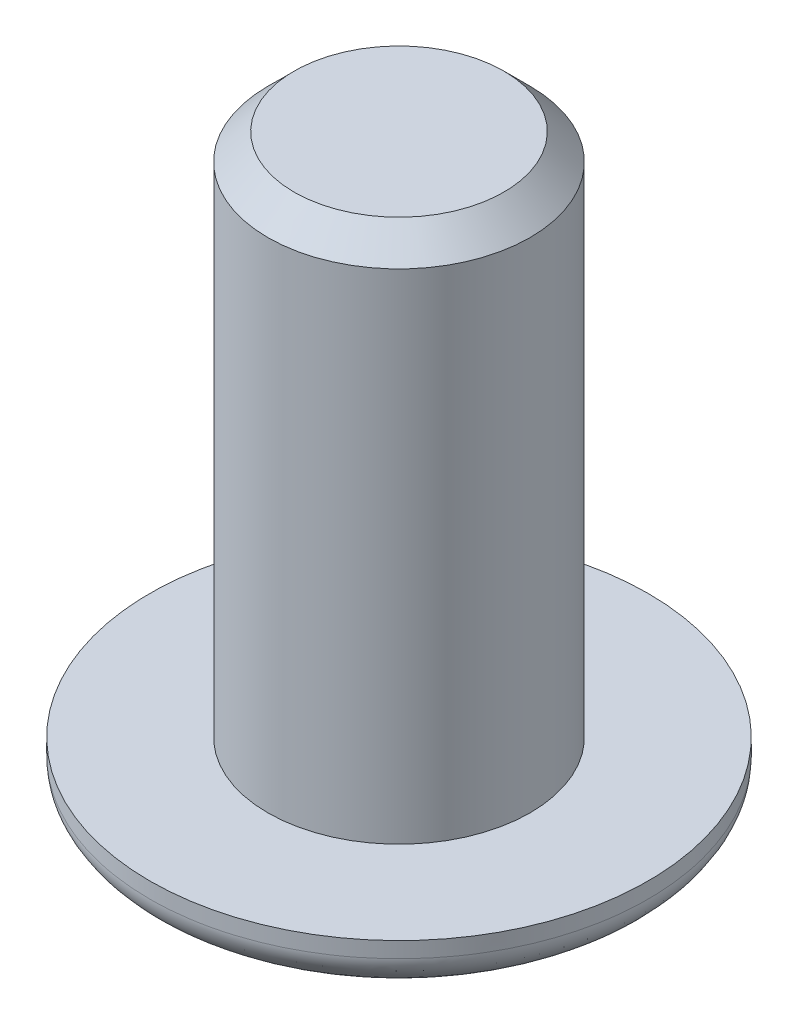
ISO-10303-21;
HEADER;
FILE_DESCRIPTION(('STEP AP214'),'2;1');
FILE_NAME('part.step','',(''),(''),'','','');
FILE_SCHEMA(('AUTOMOTIVE_DESIGN { 1 0 10303 214 1 1 1 1 }'));
ENDSEC;
DATA;
#1=APPLICATION_CONTEXT('core data for automotive mechanical design processes');
#2=APPLICATION_PROTOCOL_DEFINITION('international standard','automotive_design',2000,#1);
#3=PRODUCT_CONTEXT('',#1,'mechanical');
#4=PRODUCT('Part','Part','',(#3));
#5=PRODUCT_RELATED_PRODUCT_CATEGORY('part','',(#4));
#6=PRODUCT_DEFINITION_FORMATION('','',#4);
#7=PRODUCT_DEFINITION_CONTEXT('part definition',#1,'design');
#8=PRODUCT_DEFINITION('design','',#6,#7);
#9=PRODUCT_DEFINITION_SHAPE('','',#8);
#10=(LENGTH_UNIT() NAMED_UNIT(*) SI_UNIT(.MILLI.,.METRE.));
#11=(NAMED_UNIT(*) PLANE_ANGLE_UNIT() SI_UNIT($,.RADIAN.));
#12=(NAMED_UNIT(*) SI_UNIT($,.STERADIAN.) SOLID_ANGLE_UNIT());
#13=UNCERTAINTY_MEASURE_WITH_UNIT(LENGTH_MEASURE(1.E-05),#10,'distance_accuracy_value','');
#14=(GEOMETRIC_REPRESENTATION_CONTEXT(3) GLOBAL_UNCERTAINTY_ASSIGNED_CONTEXT((#13)) GLOBAL_UNIT_ASSIGNED_CONTEXT((#10,
#11,#12)) REPRESENTATION_CONTEXT('',''));
#15=CARTESIAN_POINT('',(0.,0.,0.));
#16=DIRECTION('',(0.,0.,1.));
#17=DIRECTION('',(1.,0.,0.));
#18=AXIS2_PLACEMENT_3D('',#15,#16,#17);
#19=CARTESIAN_POINT('',(0.,1.3,0.));
#20=DIRECTION('',(0.,1.,0.));
#21=DIRECTION('',(0.,0.,1.));
#22=AXIS2_PLACEMENT_3D('',#19,#20,#21);
#23=PLANE('',#22);
#24=CARTESIAN_POINT('',(0.,1.3,0.));
#25=DIRECTION('',(0.,1.,0.));
#26=DIRECTION('',(0.,0.,1.));
#27=AXIS2_PLACEMENT_3D('',#24,#25,#26);
#28=CIRCLE('',#27,2.5);
#29=CARTESIAN_POINT('',(0.,1.3,2.5));
#30=VERTEX_POINT('',#29);
#31=EDGE_CURVE('E295',#30,#30,#28,.T.);
#32=ORIENTED_EDGE('',*,*,#31,.F.);
#33=EDGE_LOOP('',(#32));
#34=FACE_BOUND('',#33,.T.);
#35=CARTESIAN_POINT('',(0.,1.3,0.));
#36=DIRECTION('',(0.,1.,0.));
#37=DIRECTION('',(0.,0.,1.));
#38=AXIS2_PLACEMENT_3D('',#35,#36,#37);
#39=CIRCLE('',#38,4.75);
#40=CARTESIAN_POINT('',(0.,1.3,4.75));
#41=VERTEX_POINT('',#40);
#42=EDGE_CURVE('E134',#41,#41,#39,.T.);
#43=ORIENTED_EDGE('',*,*,#42,.T.);
#44=EDGE_LOOP('',(#43));
#45=FACE_BOUND('',#44,.T.);
#46=ADVANCED_FACE('F39',(#34,#45),#23,.T.);
#47=CARTESIAN_POINT('',(0.,0.,0.));
#48=DIRECTION('',(0.,1.,0.));
#49=DIRECTION('',(0.,0.,1.));
#50=AXIS2_PLACEMENT_3D('',#47,#48,#49);
#51=PLANE('',#50);
#52=CARTESIAN_POINT('',(0.,0.,2.75));
#53=CARTESIAN_POINT('',(0.359974150290737,0.,2.75));
#54=CARTESIAN_POINT('',(0.719806689317475,0.,2.67842485780194));
#55=CARTESIAN_POINT('',(1.38495218869052,0.,2.40291257101014));
#56=CARTESIAN_POINT('',(1.69000348554074,0.,2.19908381098528));
#57=CARTESIAN_POINT('',(2.19908381098528,0.,1.69000348554074));
#58=CARTESIAN_POINT('',(2.40291257101014,0.,1.38495218869056));
#59=CARTESIAN_POINT('',(2.67842485780194,0.,0.719806689317434));
#60=CARTESIAN_POINT('',(2.75,0.,0.359974150290516));
#61=CARTESIAN_POINT('',(2.75,0.,-0.359974150290515));
#62=CARTESIAN_POINT('',(2.67842485780194,0.,-0.719806689317437));
#63=CARTESIAN_POINT('',(2.40291257101014,0.,-1.38495218869056));
#64=CARTESIAN_POINT('',(2.19908381098527,0.,-1.69000348554074));
#65=CARTESIAN_POINT('',(1.69000348554073,0.,-2.19908381098528));
#66=CARTESIAN_POINT('',(1.38495218869055,0.,-2.40291257101014));
#67=CARTESIAN_POINT('',(0.719806689317447,0.,-2.67842485780193));
#68=CARTESIAN_POINT('',(0.359974150290516,0.,-2.75));
#69=CARTESIAN_POINT('',(-0.359974150290515,0.,-2.75));
#70=CARTESIAN_POINT('',(-0.71980668931744,0.,-2.67842485780193));
#71=CARTESIAN_POINT('',(-1.38495218869055,0.,-2.40291257101015));
#72=CARTESIAN_POINT('',(-1.69000348554074,0.,-2.19908381098527));
#73=CARTESIAN_POINT('',(-2.19908381098528,0.,-1.69000348554073));
#74=CARTESIAN_POINT('',(-2.40291257101014,0.,-1.38495218869055));
#75=CARTESIAN_POINT('',(-2.67842485780193,0.,-0.719806689317447));
#76=CARTESIAN_POINT('',(-2.75,0.,-0.359974150290512));
#77=CARTESIAN_POINT('',(-2.75,0.,0.35997415029052));
#78=CARTESIAN_POINT('',(-2.67842485780193,0.,0.719806689317439));
#79=CARTESIAN_POINT('',(-2.40291257101015,0.,1.38495218869055));
#80=CARTESIAN_POINT('',(-2.19908381098532,0.,1.69000348554073));
#81=CARTESIAN_POINT('',(-1.6900034855407,0.,2.19908381098527));
#82=CARTESIAN_POINT('',(-1.38495218869055,0.,2.40291257101014));
#83=CARTESIAN_POINT('',(-0.719806689317447,0.,2.67842485780193));
#84=CARTESIAN_POINT('',(-0.359974150290737,0.,2.75));
#85=CARTESIAN_POINT('',(0.,0.,2.75));
#86=(BOUNDED_CURVE() B_SPLINE_CURVE(3,(#52,#53,#54,#55,#56,#57,#58,#59,#60,#61,#62,#63,#64,#65,
#66,#67,#68,#69,#70,#71,#72,#73,#74,#75,#76,#77,#78,#79,#80,#81,#82,#83,#84,#85),.UNSPECIFIED.,
.T.,.F.) B_SPLINE_CURVE_WITH_KNOTS((4,2,2,2,2,2,2,2,2,2,2,2,2,2,2,2,4),(0.,0.392699081698724,
0.785398163397448,1.17809724509617,1.5707963267949,1.96349540849362,2.35619449019234,
2.74889357189107,3.14159265358979,3.53429173528852,3.92699081698724,4.31968989868597,
4.71238898038469,5.10508806208341,5.49778714378214,5.89048622548086,6.28318530717959),
.UNSPECIFIED.) CURVE() GEOMETRIC_REPRESENTATION_ITEM() RATIONAL_B_SPLINE_CURVE((1.,1.,1.,1.,1.,
1.,1.,1.,1.,1.,1.,1.,1.,1.,1.,1.,1.,1.,1.,1.,1.,1.,1.,1.,1.,1.,1.,1.,1.,1.,1.,1.,1.,1.)) REPRESENTATION_ITEM(''));
#87=CARTESIAN_POINT('',(0.,0.,2.75));
#88=VERTEX_POINT('',#87);
#89=EDGE_CURVE('E12',#88,#88,#86,.F.);
#90=ORIENTED_EDGE('',*,*,#89,.T.);
#91=EDGE_LOOP('',(#90));
#92=FACE_BOUND('',#91,.T.);
#93=DIRECTION('',(0.866025403784439,0.,0.5));
#94=VECTOR('',#93,1.);
#95=CARTESIAN_POINT('',(-1.50000000000001,0.,0.866025403784444));
#96=LINE('',#95,#94);
#97=CARTESIAN_POINT('',(-1.50000000000001,0.,0.866025403784444));
#98=VERTEX_POINT('',#97);
#99=CARTESIAN_POINT('',(0.,0.,1.73205080756888));
#100=VERTEX_POINT('',#99);
#101=EDGE_CURVE('E60',#98,#100,#96,.T.);
#102=ORIENTED_EDGE('',*,*,#101,.T.);
#103=DIRECTION('',(0.866025403784439,0.,-0.5));
#104=VECTOR('',#103,1.);
#105=CARTESIAN_POINT('',(0.,0.,1.73205080756888));
#106=LINE('',#105,#104);
#107=CARTESIAN_POINT('',(1.5,0.,0.866025403784438));
#108=VERTEX_POINT('',#107);
#109=EDGE_CURVE('E120',#100,#108,#106,.T.);
#110=ORIENTED_EDGE('',*,*,#109,.T.);
#111=DIRECTION('',(0.,0.,-1.));
#112=VECTOR('',#111,1.);
#113=CARTESIAN_POINT('',(1.5,0.,0.866025403784438));
#114=LINE('',#113,#112);
#115=CARTESIAN_POINT('',(1.5,0.,-0.866025403784452));
#116=VERTEX_POINT('',#115);
#117=EDGE_CURVE('E118',#108,#116,#114,.T.);
#118=ORIENTED_EDGE('',*,*,#117,.T.);
#119=DIRECTION('',(-0.866025403784438,0.,-0.500000000000001));
#120=VECTOR('',#119,1.);
#121=CARTESIAN_POINT('',(1.5,0.,-0.866025403784452));
#122=LINE('',#121,#120);
#123=CARTESIAN_POINT('',(0.,0.,-1.73205080756889));
#124=VERTEX_POINT('',#123);
#125=EDGE_CURVE('E96',#116,#124,#122,.T.);
#126=ORIENTED_EDGE('',*,*,#125,.T.);
#127=DIRECTION('',(-0.866025403784438,0.,0.5));
#128=VECTOR('',#127,1.);
#129=CARTESIAN_POINT('',(0.,0.,-1.73205080756889));
#130=LINE('',#129,#128);
#131=CARTESIAN_POINT('',(-1.50000000000001,0.,-0.866025403784447));
#132=VERTEX_POINT('',#131);
#133=EDGE_CURVE('E107',#124,#132,#130,.T.);
#134=ORIENTED_EDGE('',*,*,#133,.T.);
#135=DIRECTION('',(0.,0.,1.));
#136=VECTOR('',#135,1.);
#137=CARTESIAN_POINT('',(-1.50000000000001,0.,-0.866025403784447));
#138=LINE('',#137,#136);
#139=EDGE_CURVE('E113',#132,#98,#138,.T.);
#140=ORIENTED_EDGE('',*,*,#139,.T.);
#141=EDGE_LOOP('',(#102,#110,#118,#126,#134,#140));
#142=FACE_BOUND('',#141,.T.);
#143=ADVANCED_FACE('F115',(#92,#142),#51,.F.);
#144=CARTESIAN_POINT('',(0.,1.3,0.));
#145=DIRECTION('',(0.,-1.,0.));
#146=DIRECTION('',(0.,0.,-1.));
#147=AXIS2_PLACEMENT_3D('',#144,#145,#146);
#148=CYLINDRICAL_SURFACE('',#147,4.75);
#149=CARTESIAN_POINT('',(0.,1.,4.75));
#150=CARTESIAN_POINT('',(-0.621773532320364,1.,4.75));
#151=CARTESIAN_POINT('',(-1.24330246336651,1.,4.62637020893059));
#152=CARTESIAN_POINT('',(-2.39219014410186,1.,4.15048534992663));
#153=CARTESIAN_POINT('',(-2.91909692957037,1.,3.79841749170183));
#154=CARTESIAN_POINT('',(-3.79841749170185,1.,2.91909692957035));
#155=CARTESIAN_POINT('',(-4.15048534992664,1.,2.39219014410185));
#156=CARTESIAN_POINT('',(-4.62637020893059,1.,1.24330246336649));
#157=CARTESIAN_POINT('',(-4.75,1.,0.62177353231999));
#158=CARTESIAN_POINT('',(-4.75,1.,-0.621773532319975));
#159=CARTESIAN_POINT('',(-4.62637020893059,1.,-1.24330246336651));
#160=CARTESIAN_POINT('',(-4.15048534992663,1.,-2.39219014410186));
#161=CARTESIAN_POINT('',(-3.79841749170184,1.,-2.91909692957036));
#162=CARTESIAN_POINT('',(-2.91909692957036,1.,-3.79841749170184));
#163=CARTESIAN_POINT('',(-2.39219014410185,1.,-4.15048534992664));
#164=CARTESIAN_POINT('',(-1.24330246336649,1.,-4.62637020893059));
#165=CARTESIAN_POINT('',(-0.621773532319981,1.,-4.75));
#166=CARTESIAN_POINT('',(0.621773532319982,1.,-4.75));
#167=CARTESIAN_POINT('',(1.24330246336651,1.,-4.62637020893059));
#168=CARTESIAN_POINT('',(2.39219014410186,1.,-4.15048534992663));
#169=CARTESIAN_POINT('',(2.91909692957036,1.,-3.79841749170184));
#170=CARTESIAN_POINT('',(3.79841749170184,1.,-2.91909692957036));
#171=CARTESIAN_POINT('',(4.15048534992661,1.,-2.39219014410191));
#172=CARTESIAN_POINT('',(4.62637020893061,1.,-1.24330246336645));
#173=CARTESIAN_POINT('',(4.75,1.,-0.621773532319981));
#174=CARTESIAN_POINT('',(4.75,1.,0.621773532319982));
#175=CARTESIAN_POINT('',(4.62637020893059,1.,1.2433024633665));
#176=CARTESIAN_POINT('',(4.15048534992664,1.,2.39219014410185));
#177=CARTESIAN_POINT('',(3.79841749170187,1.,2.91909692957033));
#178=CARTESIAN_POINT('',(2.91909692957033,1.,3.79841749170187));
#179=CARTESIAN_POINT('',(2.39219014410182,1.,4.15048534992665));
#180=CARTESIAN_POINT('',(1.24330246336654,1.,4.62637020893057));
#181=CARTESIAN_POINT('',(0.621773532320364,1.,4.75));
#182=CARTESIAN_POINT('',(0.,1.,4.75));
#183=(BOUNDED_CURVE() B_SPLINE_CURVE(3,(#149,#150,#151,#152,#153,#154,#155,#156,#157,#158,#159,
#160,#161,#162,#163,#164,#165,#166,#167,#168,#169,#170,#171,#172,#173,#174,#175,#176,#177,#178,
#179,#180,#181,#182),.UNSPECIFIED.,.T.,.F.) B_SPLINE_CURVE_WITH_KNOTS((4,2,2,2,2,2,2,2,2,2,2,2,
2,2,2,2,4),(0.,0.392699081698725,0.785398163397448,1.17809724509617,1.5707963267949,
1.96349540849362,2.35619449019234,2.74889357189107,3.14159265358979,3.53429173528852,
3.92699081698724,4.31968989868597,4.71238898038469,5.10508806208341,5.49778714378214,
5.89048622548086,6.28318530717959),
.UNSPECIFIED.) CURVE() GEOMETRIC_REPRESENTATION_ITEM() RATIONAL_B_SPLINE_CURVE((1.,1.,1.,1.,1.,
1.,1.,1.,1.,1.,1.,1.,1.,1.,1.,1.,1.,1.,1.,1.,1.,1.,1.,1.,1.,1.,1.,1.,1.,1.,1.,1.,1.,1.)) REPRESENTATION_ITEM(''));
#184=CARTESIAN_POINT('',(0.,1.,4.75));
#185=VERTEX_POINT('',#184);
#186=EDGE_CURVE('E53',#185,#185,#183,.F.);
#187=ORIENTED_EDGE('',*,*,#186,.T.);
#188=EDGE_LOOP('',(#187));
#189=FACE_BOUND('',#188,.T.);
#190=ORIENTED_EDGE('',*,*,#42,.F.);
#191=EDGE_LOOP('',(#190));
#192=FACE_BOUND('',#191,.T.);
#193=ADVANCED_FACE('F152',(#189,#192),#148,.T.);
#194=CARTESIAN_POINT('',(-1.50000000000001,1.3,0.866025403784444));
#195=DIRECTION('',(0.5,0.,-0.866025403784439));
#196=DIRECTION('',(-0.866025403784439,0.,-0.5));
#197=AXIS2_PLACEMENT_3D('',#194,#195,#196);
#198=PLANE('',#197);
#199=ORIENTED_EDGE('',*,*,#101,.F.);
#200=DIRECTION('',(0.,-1.,0.));
#201=VECTOR('',#200,1.);
#202=CARTESIAN_POINT('',(-1.50000000000001,1.3,0.866025403784444));
#203=LINE('',#202,#201);
#204=CARTESIAN_POINT('',(-1.50000000000001,1.3,0.866025403784444));
#205=VERTEX_POINT('',#204);
#206=EDGE_CURVE('E125',#205,#98,#203,.T.);
#207=ORIENTED_EDGE('',*,*,#206,.F.);
#208=DIRECTION('',(0.866025403784439,0.,0.5));
#209=VECTOR('',#208,1.);
#210=CARTESIAN_POINT('',(-1.50000000000001,1.3,0.866025403784444));
#211=LINE('',#210,#209);
#212=CARTESIAN_POINT('',(0.,1.3,1.73205080756888));
#213=VERTEX_POINT('',#212);
#214=EDGE_CURVE('E69',#205,#213,#211,.T.);
#215=ORIENTED_EDGE('',*,*,#214,.T.);
#216=DIRECTION('',(0.,-1.,0.));
#217=VECTOR('',#216,1.);
#218=CARTESIAN_POINT('',(0.,1.3,1.73205080756888));
#219=LINE('',#218,#217);
#220=EDGE_CURVE('E132',#213,#100,#219,.T.);
#221=ORIENTED_EDGE('',*,*,#220,.T.);
#222=EDGE_LOOP('',(#199,#207,#215,#221));
#223=FACE_BOUND('',#222,.T.);
#224=ADVANCED_FACE('F161',(#223),#198,.T.);
#225=CARTESIAN_POINT('',(0.,1.3,1.73205080756888));
#226=DIRECTION('',(-0.5,0.,-0.866025403784439));
#227=DIRECTION('',(-0.866025403784439,0.,0.5));
#228=AXIS2_PLACEMENT_3D('',#225,#226,#227);
#229=PLANE('',#228);
#230=ORIENTED_EDGE('',*,*,#109,.F.);
#231=ORIENTED_EDGE('',*,*,#220,.F.);
#232=DIRECTION('',(0.866025403784439,0.,-0.5));
#233=VECTOR('',#232,1.);
#234=CARTESIAN_POINT('',(0.,1.3,1.73205080756888));
#235=LINE('',#234,#233);
#236=CARTESIAN_POINT('',(1.5,1.3,0.866025403784438));
#237=VERTEX_POINT('',#236);
#238=EDGE_CURVE('E300',#213,#237,#235,.T.);
#239=ORIENTED_EDGE('',*,*,#238,.T.);
#240=DIRECTION('',(0.,-1.,0.));
#241=VECTOR('',#240,1.);
#242=CARTESIAN_POINT('',(1.5,1.3,0.866025403784438));
#243=LINE('',#242,#241);
#244=EDGE_CURVE('E130',#237,#108,#243,.T.);
#245=ORIENTED_EDGE('',*,*,#244,.T.);
#246=EDGE_LOOP('',(#230,#231,#239,#245));
#247=FACE_BOUND('',#246,.T.);
#248=ADVANCED_FACE('F192',(#247),#229,.T.);
#249=CARTESIAN_POINT('',(1.5,1.3,0.866025403784438));
#250=DIRECTION('',(-1.,0.,0.));
#251=DIRECTION('',(0.,0.,1.));
#252=AXIS2_PLACEMENT_3D('',#249,#250,#251);
#253=PLANE('',#252);
#254=ORIENTED_EDGE('',*,*,#117,.F.);
#255=ORIENTED_EDGE('',*,*,#244,.F.);
#256=DIRECTION('',(0.,0.,-1.));
#257=VECTOR('',#256,1.);
#258=CARTESIAN_POINT('',(1.5,1.3,0.866025403784438));
#259=LINE('',#258,#257);
#260=CARTESIAN_POINT('',(1.5,1.3,-0.866025403784452));
#261=VERTEX_POINT('',#260);
#262=EDGE_CURVE('E303',#237,#261,#259,.T.);
#263=ORIENTED_EDGE('',*,*,#262,.T.);
#264=DIRECTION('',(0.,-1.,0.));
#265=VECTOR('',#264,1.);
#266=CARTESIAN_POINT('',(1.5,1.3,-0.866025403784452));
#267=LINE('',#266,#265);
#268=EDGE_CURVE('E103',#261,#116,#267,.T.);
#269=ORIENTED_EDGE('',*,*,#268,.T.);
#270=EDGE_LOOP('',(#254,#255,#263,#269));
#271=FACE_BOUND('',#270,.T.);
#272=ADVANCED_FACE('F195',(#271),#253,.T.);
#273=CARTESIAN_POINT('',(1.5,1.3,-0.866025403784452));
#274=DIRECTION('',(-0.500000000000001,0.,0.866025403784438));
#275=DIRECTION('',(0.866025403784438,0.,0.500000000000001));
#276=AXIS2_PLACEMENT_3D('',#273,#274,#275);
#277=PLANE('',#276);
#278=ORIENTED_EDGE('',*,*,#125,.F.);
#279=ORIENTED_EDGE('',*,*,#268,.F.);
#280=DIRECTION('',(-0.866025403784438,0.,-0.500000000000001));
#281=VECTOR('',#280,1.);
#282=CARTESIAN_POINT('',(1.5,1.3,-0.866025403784452));
#283=LINE('',#282,#281);
#284=CARTESIAN_POINT('',(0.,1.3,-1.73205080756889));
#285=VERTEX_POINT('',#284);
#286=EDGE_CURVE('E100',#261,#285,#283,.T.);
#287=ORIENTED_EDGE('',*,*,#286,.T.);
#288=DIRECTION('',(0.,-1.,0.));
#289=VECTOR('',#288,1.);
#290=CARTESIAN_POINT('',(0.,1.3,-1.73205080756889));
#291=LINE('',#290,#289);
#292=EDGE_CURVE('E91',#285,#124,#291,.T.);
#293=ORIENTED_EDGE('',*,*,#292,.T.);
#294=EDGE_LOOP('',(#278,#279,#287,#293));
#295=FACE_BOUND('',#294,.T.);
#296=ADVANCED_FACE('F93',(#295),#277,.T.);
#297=CARTESIAN_POINT('',(0.,1.3,-1.73205080756889));
#298=DIRECTION('',(0.5,0.,0.866025403784438));
#299=DIRECTION('',(0.866025403784438,0.,-0.5));
#300=AXIS2_PLACEMENT_3D('',#297,#298,#299);
#301=PLANE('',#300);
#302=ORIENTED_EDGE('',*,*,#133,.F.);
#303=ORIENTED_EDGE('',*,*,#292,.F.);
#304=DIRECTION('',(-0.866025403784438,0.,0.5));
#305=VECTOR('',#304,1.);
#306=CARTESIAN_POINT('',(0.,1.3,-1.73205080756889));
#307=LINE('',#306,#305);
#308=CARTESIAN_POINT('',(-1.50000000000001,1.3,-0.866025403784447));
#309=VERTEX_POINT('',#308);
#310=EDGE_CURVE('E307',#285,#309,#307,.T.);
#311=ORIENTED_EDGE('',*,*,#310,.T.);
#312=DIRECTION('',(0.,-1.,0.));
#313=VECTOR('',#312,1.);
#314=CARTESIAN_POINT('',(-1.50000000000001,1.3,-0.866025403784447));
#315=LINE('',#314,#313);
#316=EDGE_CURVE('E104',#309,#132,#315,.T.);
#317=ORIENTED_EDGE('',*,*,#316,.T.);
#318=EDGE_LOOP('',(#302,#303,#311,#317));
#319=FACE_BOUND('',#318,.T.);
#320=ADVANCED_FACE('F108',(#319),#301,.T.);
#321=CARTESIAN_POINT('',(-1.50000000000001,1.3,-0.866025403784447));
#322=DIRECTION('',(1.,0.,0.));
#323=DIRECTION('',(0.,0.,-1.));
#324=AXIS2_PLACEMENT_3D('',#321,#322,#323);
#325=PLANE('',#324);
#326=ORIENTED_EDGE('',*,*,#139,.F.);
#327=ORIENTED_EDGE('',*,*,#316,.F.);
#328=DIRECTION('',(0.,0.,1.));
#329=VECTOR('',#328,1.);
#330=CARTESIAN_POINT('',(-1.50000000000001,1.3,-0.866025403784447));
#331=LINE('',#330,#329);
#332=EDGE_CURVE('E127',#309,#205,#331,.T.);
#333=ORIENTED_EDGE('',*,*,#332,.T.);
#334=ORIENTED_EDGE('',*,*,#206,.T.);
#335=EDGE_LOOP('',(#326,#327,#333,#334));
#336=FACE_BOUND('',#335,.T.);
#337=ADVANCED_FACE('F204',(#336),#325,.T.);
#338=CARTESIAN_POINT('',(0.,1.3,0.));
#339=DIRECTION('',(0.,1.,0.));
#340=DIRECTION('',(0.,0.,1.));
#341=AXIS2_PLACEMENT_3D('',#338,#339,#340);
#342=PLANE('',#341);
#343=ORIENTED_EDGE('',*,*,#214,.F.);
#344=ORIENTED_EDGE('',*,*,#332,.F.);
#345=ORIENTED_EDGE('',*,*,#310,.F.);
#346=ORIENTED_EDGE('',*,*,#286,.F.);
#347=ORIENTED_EDGE('',*,*,#262,.F.);
#348=ORIENTED_EDGE('',*,*,#238,.F.);
#349=EDGE_LOOP('',(#343,#344,#345,#346,#347,#348));
#350=FACE_BOUND('',#349,.T.);
#351=ADVANCED_FACE('F207',(#350),#342,.F.);
#352=CARTESIAN_POINT('',(0.,11.3,0.));
#353=DIRECTION('',(0.,-1.,0.));
#354=DIRECTION('',(0.,0.,-1.));
#355=AXIS2_PLACEMENT_3D('',#352,#353,#354);
#356=CYLINDRICAL_SURFACE('',#355,2.5);
#357=CARTESIAN_POINT('',(0.,10.8,0.));
#358=DIRECTION('',(0.,1.,0.));
#359=DIRECTION('',(0.,0.,1.));
#360=AXIS2_PLACEMENT_3D('',#357,#358,#359);
#361=CIRCLE('',#360,2.5);
#362=CARTESIAN_POINT('',(0.,10.8,2.5));
#363=VERTEX_POINT('',#362);
#364=EDGE_CURVE('E140',#363,#363,#361,.F.);
#365=ORIENTED_EDGE('',*,*,#364,.T.);
#366=EDGE_LOOP('',(#365));
#367=FACE_BOUND('',#366,.T.);
#368=ORIENTED_EDGE('',*,*,#31,.T.);
#369=EDGE_LOOP('',(#368));
#370=FACE_BOUND('',#369,.T.);
#371=ADVANCED_FACE('F176',(#367,#370),#356,.T.);
#372=CARTESIAN_POINT('',(0.,11.3,0.));
#373=DIRECTION('',(0.,1.,0.));
#374=DIRECTION('',(0.,0.,1.));
#375=AXIS2_PLACEMENT_3D('',#372,#373,#374);
#376=PLANE('',#375);
#377=CARTESIAN_POINT('',(0.,11.3,0.));
#378=DIRECTION('',(0.,1.,0.));
#379=DIRECTION('',(0.,0.,1.));
#380=AXIS2_PLACEMENT_3D('',#377,#378,#379);
#381=CIRCLE('',#380,2.);
#382=CARTESIAN_POINT('',(0.,11.3,2.));
#383=VERTEX_POINT('',#382);
#384=EDGE_CURVE('E137',#383,#383,#381,.T.);
#385=ORIENTED_EDGE('',*,*,#384,.T.);
#386=EDGE_LOOP('',(#385));
#387=FACE_BOUND('',#386,.T.);
#388=ADVANCED_FACE('F169',(#387),#376,.T.);
#389=CARTESIAN_POINT('',(0.,11.3,0.));
#390=DIRECTION('',(0.,-1.,0.));
#391=DIRECTION('',(0.,0.,-1.));
#392=AXIS2_PLACEMENT_3D('',#389,#390,#391);
#393=CONICAL_SURFACE('',#392,2.,0.785398163397446);
#394=ORIENTED_EDGE('',*,*,#364,.F.);
#395=EDGE_LOOP('',(#394));
#396=FACE_BOUND('',#395,.T.);
#397=ORIENTED_EDGE('',*,*,#384,.F.);
#398=EDGE_LOOP('',(#397));
#399=FACE_BOUND('',#398,.T.);
#400=ADVANCED_FACE('F165',(#396,#399),#393,.T.);
#401=CARTESIAN_POINT('',(0.,1.,4.75));
#402=CARTESIAN_POINT('',(0.621773532320364,1.,4.75));
#403=CARTESIAN_POINT('',(1.24330246336654,1.,4.62637020893057));
#404=CARTESIAN_POINT('',(2.39219014410182,1.,4.15048534992665));
#405=CARTESIAN_POINT('',(2.91909692957033,1.,3.79841749170187));
#406=CARTESIAN_POINT('',(3.79841749170187,1.,2.91909692957033));
#407=CARTESIAN_POINT('',(4.15048534992664,1.,2.39219014410185));
#408=CARTESIAN_POINT('',(4.62637020893059,1.,1.2433024633665));
#409=CARTESIAN_POINT('',(4.75,1.,0.621773532319982));
#410=CARTESIAN_POINT('',(4.75,1.,-0.621773532319981));
#411=CARTESIAN_POINT('',(4.62637020893061,1.,-1.24330246336645));
#412=CARTESIAN_POINT('',(4.15048534992661,1.,-2.39219014410191));
#413=CARTESIAN_POINT('',(3.79841749170184,1.,-2.91909692957036));
#414=CARTESIAN_POINT('',(2.91909692957036,1.,-3.79841749170184));
#415=CARTESIAN_POINT('',(2.39219014410186,1.,-4.15048534992663));
#416=CARTESIAN_POINT('',(1.24330246336651,1.,-4.62637020893059));
#417=CARTESIAN_POINT('',(0.621773532319982,1.,-4.75));
#418=CARTESIAN_POINT('',(-0.621773532319981,1.,-4.75));
#419=CARTESIAN_POINT('',(-1.24330246336649,1.,-4.62637020893059));
#420=CARTESIAN_POINT('',(-2.39219014410185,1.,-4.15048534992664));
#421=CARTESIAN_POINT('',(-2.91909692957036,1.,-3.79841749170184));
#422=CARTESIAN_POINT('',(-3.79841749170184,1.,-2.91909692957036));
#423=CARTESIAN_POINT('',(-4.15048534992663,1.,-2.39219014410186));
#424=CARTESIAN_POINT('',(-4.62637020893059,1.,-1.24330246336651));
#425=CARTESIAN_POINT('',(-4.75,1.,-0.621773532319975));
#426=CARTESIAN_POINT('',(-4.75,1.,0.62177353231999));
#427=CARTESIAN_POINT('',(-4.62637020893059,1.,1.24330246336649));
#428=CARTESIAN_POINT('',(-4.15048534992664,1.,2.39219014410185));
#429=CARTESIAN_POINT('',(-3.79841749170185,1.,2.91909692957035));
#430=CARTESIAN_POINT('',(-2.91909692957037,1.,3.79841749170183));
#431=CARTESIAN_POINT('',(-2.39219014410186,1.,4.15048534992663));
#432=CARTESIAN_POINT('',(-1.24330246336651,1.,4.62637020893059));
#433=CARTESIAN_POINT('',(-0.621773532320364,1.,4.75));
#434=CARTESIAN_POINT('',(0.,1.,4.75));
#435=CARTESIAN_POINT('',(0.,0.,4.75));
#436=CARTESIAN_POINT('',(0.621773532320364,-1.17952791053464E-13,4.75));
#437=CARTESIAN_POINT('',(1.24330246336654,0.,4.62637020893059));
#438=CARTESIAN_POINT('',(2.39219014410181,0.,4.15048534992663));
#439=CARTESIAN_POINT('',(2.91909692957041,0.,3.7984174917018));
#440=CARTESIAN_POINT('',(3.7984174917018,0.,2.91909692957041));
#441=CARTESIAN_POINT('',(4.15048534992663,0.,2.39219014410185));
#442=CARTESIAN_POINT('',(4.62637020893059,0.,1.2433024633665));
#443=CARTESIAN_POINT('',(4.75,0.,0.621773532319982));
#444=CARTESIAN_POINT('',(4.75,0.,-0.621773532319981));
#445=CARTESIAN_POINT('',(4.62637020893075,0.,-1.24330246336651));
#446=CARTESIAN_POINT('',(4.15048534992648,0.,-2.39219014410185));
#447=CARTESIAN_POINT('',(3.79841749170184,0.,-2.91909692957036));
#448=CARTESIAN_POINT('',(2.91909692957036,0.,-3.79841749170184));
#449=CARTESIAN_POINT('',(2.39219014410186,0.,-4.15048534992662));
#450=CARTESIAN_POINT('',(1.24330246336651,0.,-4.6263702089306));
#451=CARTESIAN_POINT('',(0.621773532319982,0.,-4.75));
#452=CARTESIAN_POINT('',(-0.621773532319981,0.,-4.75));
#453=CARTESIAN_POINT('',(-1.2433024633665,0.,-4.6263702089306));
#454=CARTESIAN_POINT('',(-2.39219014410184,0.,-4.15048534992662));
#455=CARTESIAN_POINT('',(-2.91909692957036,0.,-3.79841749170184));
#456=CARTESIAN_POINT('',(-3.79841749170184,0.,-2.91909692957036));
#457=CARTESIAN_POINT('',(-4.15048534992662,0.,-2.39219014410185));
#458=CARTESIAN_POINT('',(-4.6263702089306,0.,-1.24330246336651));
#459=CARTESIAN_POINT('',(-4.75,0.,-0.621773532319975));
#460=CARTESIAN_POINT('',(-4.75,0.,0.62177353231999));
#461=CARTESIAN_POINT('',(-4.6263702089306,0.,1.2433024633665));
#462=CARTESIAN_POINT('',(-4.15048534992663,0.,2.39219014410184));
#463=CARTESIAN_POINT('',(-3.79841749170169,0.,2.91909692957035));
#464=CARTESIAN_POINT('',(-2.91909692957053,0.,3.79841749170183));
#465=CARTESIAN_POINT('',(-2.39219014410186,0.,4.15048534992662));
#466=CARTESIAN_POINT('',(-1.24330246336651,0.,4.6263702089306));
#467=CARTESIAN_POINT('',(-0.621773532320364,1.16218067577487E-13,4.75));
#468=CARTESIAN_POINT('',(0.,0.,4.75));
#469=CARTESIAN_POINT('',(0.,0.,2.75));
#470=CARTESIAN_POINT('',(0.359974150290737,0.,2.75));
#471=CARTESIAN_POINT('',(0.719806689317475,0.,2.67842485780194));
#472=CARTESIAN_POINT('',(1.38495218869052,0.,2.40291257101014));
#473=CARTESIAN_POINT('',(1.69000348554074,0.,2.19908381098528));
#474=CARTESIAN_POINT('',(2.19908381098528,0.,1.69000348554074));
#475=CARTESIAN_POINT('',(2.40291257101014,0.,1.38495218869056));
#476=CARTESIAN_POINT('',(2.67842485780194,0.,0.719806689317434));
#477=CARTESIAN_POINT('',(2.75,0.,0.359974150290516));
#478=CARTESIAN_POINT('',(2.75,0.,-0.359974150290515));
#479=CARTESIAN_POINT('',(2.67842485780194,0.,-0.719806689317437));
#480=CARTESIAN_POINT('',(2.40291257101014,0.,-1.38495218869056));
#481=CARTESIAN_POINT('',(2.19908381098527,0.,-1.69000348554074));
#482=CARTESIAN_POINT('',(1.69000348554073,0.,-2.19908381098528));
#483=CARTESIAN_POINT('',(1.38495218869055,0.,-2.40291257101014));
#484=CARTESIAN_POINT('',(0.719806689317447,0.,-2.67842485780193));
#485=CARTESIAN_POINT('',(0.359974150290516,0.,-2.75));
#486=CARTESIAN_POINT('',(-0.359974150290515,0.,-2.75));
#487=CARTESIAN_POINT('',(-0.71980668931744,0.,-2.67842485780193));
#488=CARTESIAN_POINT('',(-1.38495218869055,0.,-2.40291257101015));
#489=CARTESIAN_POINT('',(-1.69000348554074,0.,-2.19908381098527));
#490=CARTESIAN_POINT('',(-2.19908381098528,0.,-1.69000348554073));
#491=CARTESIAN_POINT('',(-2.40291257101014,0.,-1.38495218869055));
#492=CARTESIAN_POINT('',(-2.67842485780193,0.,-0.719806689317447));
#493=CARTESIAN_POINT('',(-2.75,0.,-0.359974150290512));
#494=CARTESIAN_POINT('',(-2.75,0.,0.35997415029052));
#495=CARTESIAN_POINT('',(-2.67842485780193,0.,0.719806689317439));
#496=CARTESIAN_POINT('',(-2.40291257101015,0.,1.38495218869055));
#497=CARTESIAN_POINT('',(-2.19908381098532,0.,1.69000348554073));
#498=CARTESIAN_POINT('',(-1.6900034855407,0.,2.19908381098527));
#499=CARTESIAN_POINT('',(-1.38495218869055,0.,2.40291257101014));
#500=CARTESIAN_POINT('',(-0.719806689317447,0.,2.67842485780193));
#501=CARTESIAN_POINT('',(-0.359974150290737,0.,2.75));
#502=CARTESIAN_POINT('',(0.,0.,2.75));
#503=(BOUNDED_SURFACE() B_SPLINE_SURFACE(2,3,((#401,#402,#403,#404,#405,#406,#407,#408,#409,
#410,#411,#412,#413,#414,#415,#416,#417,#418,#419,#420,#421,#422,#423,#424,#425,#426,#427,#428,
#429,#430,#431,#432,#433,#434),(#435,#436,#437,#438,#439,#440,#441,#442,#443,#444,#445,#446,
#447,#448,#449,#450,#451,#452,#453,#454,#455,#456,#457,#458,#459,#460,#461,#462,#463,#464,#465,
#466,#467,#468),(#469,#470,#471,#472,#473,#474,#475,#476,#477,#478,#479,#480,#481,#482,#483,
#484,#485,#486,#487,#488,#489,#490,#491,#492,#493,#494,#495,#496,#497,#498,#499,#500,#501,
#502)),.UNSPECIFIED.,.F.,.T.,.F.) B_SPLINE_SURFACE_WITH_KNOTS((3,3),(4,2,2,2,2,2,2,2,2,2,2,2,2,
2,2,2,4),(0.,1.),(0.,0.392699081698724,0.785398163397448,1.17809724509617,1.5707963267949,
1.96349540849362,2.35619449019234,2.74889357189107,3.14159265358979,3.53429173528852,
3.92699081698724,4.31968989868597,4.71238898038469,5.10508806208341,5.49778714378214,
5.89048622548086,6.28318530717959),
.UNSPECIFIED.) GEOMETRIC_REPRESENTATION_ITEM() RATIONAL_B_SPLINE_SURFACE(((1.,1.,1.,1.,1.,1.,1.,
1.,1.,1.,1.,1.,1.,1.,1.,1.,1.,1.,1.,1.,1.,1.,1.,1.,1.,1.,1.,1.,1.,1.,1.,1.,1.,1.),
(0.707106781186547,0.707106781186547,0.707106781186548,0.707106781186548,0.707106781186548,
0.707106781186548,0.707106781186548,0.707106781186548,0.707106781186547,0.707106781186547,
0.707106781186548,0.707106781186548,0.707106781186548,0.707106781186548,0.707106781186548,
0.707106781186548,0.707106781186547,0.707106781186547,0.707106781186548,0.707106781186548,
0.707106781186548,0.707106781186548,0.707106781186548,0.707106781186548,0.707106781186547,
0.707106781186547,0.707106781186548,0.707106781186548,0.707106781186548,0.707106781186548,
0.707106781186548,0.707106781186548,0.707106781186547,0.707106781186547),(1.,1.,1.,1.,1.,1.,1.,
1.,1.,1.,1.,1.,1.,1.,1.,1.,1.,1.,1.,1.,1.,1.,1.,1.,1.,1.,1.,1.,1.,1.,1.,1.,1.,1.))) REPRESENTATION_ITEM('') SURFACE());
#504=ORIENTED_EDGE('',*,*,#89,.F.);
#505=EDGE_LOOP('',(#504));
#506=FACE_BOUND('',#505,.T.);
#507=ORIENTED_EDGE('',*,*,#186,.F.);
#508=EDGE_LOOP('',(#507));
#509=FACE_BOUND('',#508,.T.);
#510=ADVANCED_FACE('F42',(#506,#509),#503,.T.);
#511=CLOSED_SHELL('',(#46,#143,#193,#224,#248,#272,#296,#320,#337,#351,#371,#388,#400,#510));
#512=MANIFOLD_SOLID_BREP('B2',#511);
#513=ADVANCED_BREP_SHAPE_REPRESENTATION('',(#18,#512),#14);
#514=SHAPE_DEFINITION_REPRESENTATION(#9,#513);
ENDSEC;
END-ISO-10303-21;
